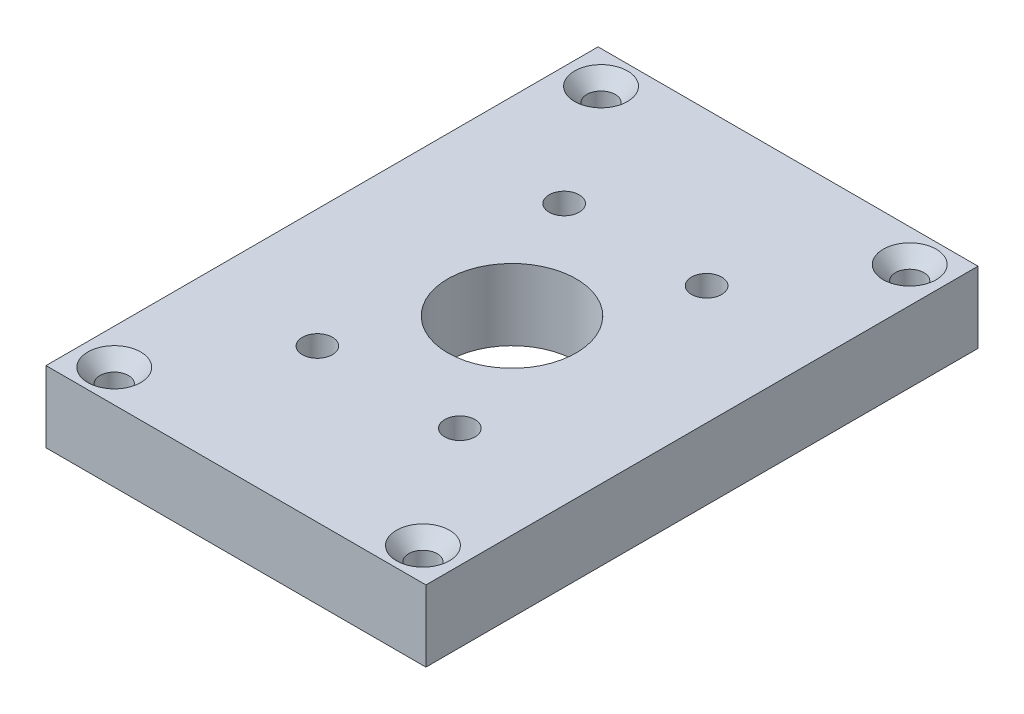
ISO-10303-21;
HEADER;
FILE_DESCRIPTION(('STEP AP214'),'2;1');
FILE_NAME('part.step','',(''),(''),'','','');
FILE_SCHEMA(('AUTOMOTIVE_DESIGN { 1 0 10303 214 1 1 1 1 }'));
ENDSEC;
DATA;
#1=APPLICATION_CONTEXT('core data for automotive mechanical design processes');
#2=APPLICATION_PROTOCOL_DEFINITION('international standard','automotive_design',2000,#1);
#3=PRODUCT_CONTEXT('',#1,'mechanical');
#4=PRODUCT('Part','Part','',(#3));
#5=PRODUCT_RELATED_PRODUCT_CATEGORY('part','',(#4));
#6=PRODUCT_DEFINITION_FORMATION('','',#4);
#7=PRODUCT_DEFINITION_CONTEXT('part definition',#1,'design');
#8=PRODUCT_DEFINITION('design','',#6,#7);
#9=PRODUCT_DEFINITION_SHAPE('','',#8);
#10=(LENGTH_UNIT() NAMED_UNIT(*) SI_UNIT(.MILLI.,.METRE.));
#11=(NAMED_UNIT(*) PLANE_ANGLE_UNIT() SI_UNIT($,.RADIAN.));
#12=(NAMED_UNIT(*) SI_UNIT($,.STERADIAN.) SOLID_ANGLE_UNIT());
#13=UNCERTAINTY_MEASURE_WITH_UNIT(LENGTH_MEASURE(1.E-05),#10,'distance_accuracy_value','');
#14=(GEOMETRIC_REPRESENTATION_CONTEXT(3) GLOBAL_UNCERTAINTY_ASSIGNED_CONTEXT((#13)) GLOBAL_UNIT_ASSIGNED_CONTEXT((#10,
#11,#12)) REPRESENTATION_CONTEXT('',''));
#15=CARTESIAN_POINT('',(0.,0.,0.));
#16=DIRECTION('',(0.,0.,1.));
#17=DIRECTION('',(1.,0.,0.));
#18=AXIS2_PLACEMENT_3D('',#15,#16,#17);
#19=CARTESIAN_POINT('',(25.4,9.525,-36.909375));
#20=DIRECTION('',(0.,-1.,0.));
#21=DIRECTION('',(0.,0.,-1.));
#22=AXIS2_PLACEMENT_3D('',#19,#20,#21);
#23=PLANE('',#22);
#24=CARTESIAN_POINT('',(-9.52499999999996,9.525,16.4977839420936));
#25=DIRECTION('',(0.,1.,0.));
#26=DIRECTION('',(0.,0.,1.));
#27=AXIS2_PLACEMENT_3D('',#24,#25,#26);
#28=CIRCLE('',#27,2.01929999999999);
#29=CARTESIAN_POINT('',(-9.52499999999996,9.525,18.5170839420936));
#30=VERTEX_POINT('',#29);
#31=EDGE_CURVE('E190',#30,#30,#28,.T.);
#32=ORIENTED_EDGE('',*,*,#31,.F.);
#33=EDGE_LOOP('',(#32));
#34=FACE_BOUND('',#33,.T.);
#35=CARTESIAN_POINT('',(-9.52500000000009,9.525,-16.4977839420935));
#36=DIRECTION('',(0.,1.,0.));
#37=DIRECTION('',(0.,0.,1.));
#38=AXIS2_PLACEMENT_3D('',#35,#36,#37);
#39=CIRCLE('',#38,2.01929999999999);
#40=CARTESIAN_POINT('',(-9.52500000000009,9.525,-14.4784839420935));
#41=VERTEX_POINT('',#40);
#42=EDGE_CURVE('E201',#41,#41,#39,.T.);
#43=ORIENTED_EDGE('',*,*,#42,.F.);
#44=EDGE_LOOP('',(#43));
#45=FACE_BOUND('',#44,.T.);
#46=CARTESIAN_POINT('',(9.52499999999996,9.525,-16.4977839420936));
#47=DIRECTION('',(0.,1.,0.));
#48=DIRECTION('',(0.,0.,1.));
#49=AXIS2_PLACEMENT_3D('',#46,#47,#48);
#50=CIRCLE('',#49,2.01929999999999);
#51=CARTESIAN_POINT('',(9.52499999999996,9.525,-14.4784839420936));
#52=VERTEX_POINT('',#51);
#53=EDGE_CURVE('E207',#52,#52,#50,.T.);
#54=ORIENTED_EDGE('',*,*,#53,.F.);
#55=EDGE_LOOP('',(#54));
#56=FACE_BOUND('',#55,.T.);
#57=CARTESIAN_POINT('',(0.,9.525,0.));
#58=DIRECTION('',(0.,1.,0.));
#59=DIRECTION('',(0.,0.,1.));
#60=AXIS2_PLACEMENT_3D('',#57,#58,#59);
#61=CIRCLE('',#60,8.5852);
#62=CARTESIAN_POINT('',(0.,9.525,8.5852));
#63=VERTEX_POINT('',#62);
#64=EDGE_CURVE('E213',#63,#63,#61,.T.);
#65=ORIENTED_EDGE('',*,*,#64,.F.);
#66=EDGE_LOOP('',(#65));
#67=FACE_BOUND('',#66,.T.);
#68=CARTESIAN_POINT('',(-20.6375,9.525,-32.54375));
#69=DIRECTION('',(0.,1.,0.));
#70=DIRECTION('',(0.,0.,1.));
#71=AXIS2_PLACEMENT_3D('',#68,#69,#70);
#72=CIRCLE('',#71,3.5433);
#73=CARTESIAN_POINT('',(-20.6375,9.525,-29.00045));
#74=VERTEX_POINT('',#73);
#75=EDGE_CURVE('E330',#74,#74,#72,.T.);
#76=ORIENTED_EDGE('',*,*,#75,.F.);
#77=EDGE_LOOP('',(#76));
#78=FACE_BOUND('',#77,.T.);
#79=CARTESIAN_POINT('',(20.6375,9.525,-32.54375));
#80=DIRECTION('',(0.,1.,0.));
#81=DIRECTION('',(0.,0.,1.));
#82=AXIS2_PLACEMENT_3D('',#79,#80,#81);
#83=CIRCLE('',#82,3.5433);
#84=CARTESIAN_POINT('',(20.6375,9.525,-29.00045));
#85=VERTEX_POINT('',#84);
#86=EDGE_CURVE('E352',#85,#85,#83,.T.);
#87=ORIENTED_EDGE('',*,*,#86,.F.);
#88=EDGE_LOOP('',(#87));
#89=FACE_BOUND('',#88,.T.);
#90=CARTESIAN_POINT('',(20.6375,9.525,32.54375));
#91=DIRECTION('',(0.,1.,0.));
#92=DIRECTION('',(0.,0.,1.));
#93=AXIS2_PLACEMENT_3D('',#90,#91,#92);
#94=CIRCLE('',#93,3.5433);
#95=CARTESIAN_POINT('',(20.6375,9.525,36.08705));
#96=VERTEX_POINT('',#95);
#97=EDGE_CURVE('E361',#96,#96,#94,.T.);
#98=ORIENTED_EDGE('',*,*,#97,.F.);
#99=EDGE_LOOP('',(#98));
#100=FACE_BOUND('',#99,.T.);
#101=CARTESIAN_POINT('',(-20.6375,9.525,32.54375));
#102=DIRECTION('',(0.,1.,0.));
#103=DIRECTION('',(0.,0.,1.));
#104=AXIS2_PLACEMENT_3D('',#101,#102,#103);
#105=CIRCLE('',#104,3.5433);
#106=CARTESIAN_POINT('',(-20.6375,9.525,36.08705));
#107=VERTEX_POINT('',#106);
#108=EDGE_CURVE('E370',#107,#107,#105,.T.);
#109=ORIENTED_EDGE('',*,*,#108,.F.);
#110=EDGE_LOOP('',(#109));
#111=FACE_BOUND('',#110,.T.);
#112=DIRECTION('',(0.,0.,-1.));
#113=VECTOR('',#112,1.);
#114=CARTESIAN_POINT('',(25.4,9.525,36.909375));
#115=LINE('',#114,#113);
#116=CARTESIAN_POINT('',(25.4,9.525,36.909375));
#117=VERTEX_POINT('',#116);
#118=CARTESIAN_POINT('',(25.4,9.525,-36.909375));
#119=VERTEX_POINT('',#118);
#120=EDGE_CURVE('E380',#117,#119,#115,.T.);
#121=ORIENTED_EDGE('',*,*,#120,.T.);
#122=DIRECTION('',(-1.,0.,0.));
#123=VECTOR('',#122,1.);
#124=CARTESIAN_POINT('',(-25.4,9.525,-36.909375));
#125=LINE('',#124,#123);
#126=CARTESIAN_POINT('',(-25.4,9.525,-36.909375));
#127=VERTEX_POINT('',#126);
#128=EDGE_CURVE('E383',#119,#127,#125,.T.);
#129=ORIENTED_EDGE('',*,*,#128,.T.);
#130=DIRECTION('',(0.,0.,1.));
#131=VECTOR('',#130,1.);
#132=CARTESIAN_POINT('',(-25.4,9.525,36.909375));
#133=LINE('',#132,#131);
#134=CARTESIAN_POINT('',(-25.4,9.525,36.909375));
#135=VERTEX_POINT('',#134);
#136=EDGE_CURVE('E386',#127,#135,#133,.T.);
#137=ORIENTED_EDGE('',*,*,#136,.T.);
#138=DIRECTION('',(1.,0.,0.));
#139=VECTOR('',#138,1.);
#140=CARTESIAN_POINT('',(-25.4,9.525,36.909375));
#141=LINE('',#140,#139);
#142=EDGE_CURVE('E388',#135,#117,#141,.T.);
#143=ORIENTED_EDGE('',*,*,#142,.T.);
#144=EDGE_LOOP('',(#121,#129,#137,#143));
#145=FACE_BOUND('',#144,.T.);
#146=CARTESIAN_POINT('',(9.5250000000002,9.525,16.4977839420934));
#147=DIRECTION('',(0.,1.,0.));
#148=DIRECTION('',(0.,0.,1.));
#149=AXIS2_PLACEMENT_3D('',#146,#147,#148);
#150=CIRCLE('',#149,2.01929999999999);
#151=CARTESIAN_POINT('',(9.5250000000002,9.525,18.5170839420934));
#152=VERTEX_POINT('',#151);
#153=EDGE_CURVE('E191',#152,#152,#150,.T.);
#154=ORIENTED_EDGE('',*,*,#153,.F.);
#155=EDGE_LOOP('',(#154));
#156=FACE_BOUND('',#155,.T.);
#157=ADVANCED_FACE('F32',(#34,#45,#56,#67,#78,#89,#100,#111,#145,#156),#23,.F.);
#158=CARTESIAN_POINT('',(25.4,9.525,36.909375));
#159=DIRECTION('',(-1.,0.,0.));
#160=DIRECTION('',(0.,0.,1.));
#161=AXIS2_PLACEMENT_3D('',#158,#159,#160);
#162=PLANE('',#161);
#163=DIRECTION('',(0.,0.,-1.));
#164=VECTOR('',#163,1.);
#165=CARTESIAN_POINT('',(25.4,0.,36.909375));
#166=LINE('',#165,#164);
#167=CARTESIAN_POINT('',(25.4,0.,36.909375));
#168=VERTEX_POINT('',#167);
#169=CARTESIAN_POINT('',(25.4,0.,-36.909375));
#170=VERTEX_POINT('',#169);
#171=EDGE_CURVE('E379',#168,#170,#166,.T.);
#172=ORIENTED_EDGE('',*,*,#171,.T.);
#173=DIRECTION('',(0.,-1.,0.));
#174=VECTOR('',#173,1.);
#175=CARTESIAN_POINT('',(25.4,9.525,-36.909375));
#176=LINE('',#175,#174);
#177=EDGE_CURVE('E11',#119,#170,#176,.T.);
#178=ORIENTED_EDGE('',*,*,#177,.F.);
#179=ORIENTED_EDGE('',*,*,#120,.F.);
#180=DIRECTION('',(0.,-1.,0.));
#181=VECTOR('',#180,1.);
#182=CARTESIAN_POINT('',(25.4,9.525,36.909375));
#183=LINE('',#182,#181);
#184=EDGE_CURVE('E390',#117,#168,#183,.T.);
#185=ORIENTED_EDGE('',*,*,#184,.T.);
#186=EDGE_LOOP('',(#172,#178,#179,#185));
#187=FACE_BOUND('',#186,.T.);
#188=ADVANCED_FACE('F34',(#187),#162,.F.);
#189=CARTESIAN_POINT('',(-25.4,9.525,-36.909375));
#190=DIRECTION('',(0.,0.,1.));
#191=DIRECTION('',(1.,0.,0.));
#192=AXIS2_PLACEMENT_3D('',#189,#190,#191);
#193=PLANE('',#192);
#194=DIRECTION('',(-1.,0.,0.));
#195=VECTOR('',#194,1.);
#196=CARTESIAN_POINT('',(-25.4,0.,-36.909375));
#197=LINE('',#196,#195);
#198=CARTESIAN_POINT('',(-25.4,0.,-36.909375));
#199=VERTEX_POINT('',#198);
#200=EDGE_CURVE('E393',#170,#199,#197,.T.);
#201=ORIENTED_EDGE('',*,*,#200,.T.);
#202=DIRECTION('',(0.,-1.,0.));
#203=VECTOR('',#202,1.);
#204=CARTESIAN_POINT('',(-25.4,9.525,-36.909375));
#205=LINE('',#204,#203);
#206=EDGE_CURVE('E40',#127,#199,#205,.T.);
#207=ORIENTED_EDGE('',*,*,#206,.F.);
#208=ORIENTED_EDGE('',*,*,#128,.F.);
#209=ORIENTED_EDGE('',*,*,#177,.T.);
#210=EDGE_LOOP('',(#201,#207,#208,#209));
#211=FACE_BOUND('',#210,.T.);
#212=ADVANCED_FACE('F423',(#211),#193,.F.);
#213=CARTESIAN_POINT('',(-25.4,9.525,36.909375));
#214=DIRECTION('',(1.,0.,0.));
#215=DIRECTION('',(0.,0.,-1.));
#216=AXIS2_PLACEMENT_3D('',#213,#214,#215);
#217=PLANE('',#216);
#218=DIRECTION('',(0.,0.,1.));
#219=VECTOR('',#218,1.);
#220=CARTESIAN_POINT('',(-25.4,0.,36.909375));
#221=LINE('',#220,#219);
#222=CARTESIAN_POINT('',(-25.4,0.,36.909375));
#223=VERTEX_POINT('',#222);
#224=EDGE_CURVE('E395',#199,#223,#221,.T.);
#225=ORIENTED_EDGE('',*,*,#224,.T.);
#226=DIRECTION('',(0.,-1.,0.));
#227=VECTOR('',#226,1.);
#228=CARTESIAN_POINT('',(-25.4,9.525,36.909375));
#229=LINE('',#228,#227);
#230=EDGE_CURVE('E400',#135,#223,#229,.T.);
#231=ORIENTED_EDGE('',*,*,#230,.F.);
#232=ORIENTED_EDGE('',*,*,#136,.F.);
#233=ORIENTED_EDGE('',*,*,#206,.T.);
#234=EDGE_LOOP('',(#225,#231,#232,#233));
#235=FACE_BOUND('',#234,.T.);
#236=ADVANCED_FACE('F407',(#235),#217,.F.);
#237=CARTESIAN_POINT('',(-25.4,9.525,36.909375));
#238=DIRECTION('',(0.,0.,-1.));
#239=DIRECTION('',(-1.,0.,0.));
#240=AXIS2_PLACEMENT_3D('',#237,#238,#239);
#241=PLANE('',#240);
#242=DIRECTION('',(1.,0.,0.));
#243=VECTOR('',#242,1.);
#244=CARTESIAN_POINT('',(-25.4,0.,36.909375));
#245=LINE('',#244,#243);
#246=EDGE_CURVE('E384',#223,#168,#245,.T.);
#247=ORIENTED_EDGE('',*,*,#246,.T.);
#248=ORIENTED_EDGE('',*,*,#184,.F.);
#249=ORIENTED_EDGE('',*,*,#142,.F.);
#250=ORIENTED_EDGE('',*,*,#230,.T.);
#251=EDGE_LOOP('',(#247,#248,#249,#250));
#252=FACE_BOUND('',#251,.T.);
#253=ADVANCED_FACE('F416',(#252),#241,.F.);
#254=CARTESIAN_POINT('',(25.4,0.,-36.909375));
#255=DIRECTION('',(0.,-1.,0.));
#256=DIRECTION('',(0.,0.,-1.));
#257=AXIS2_PLACEMENT_3D('',#254,#255,#256);
#258=PLANE('',#257);
#259=CARTESIAN_POINT('',(11.1125,0.,-26.0731));
#260=DIRECTION('',(0.,-1.,0.));
#261=DIRECTION('',(0.,0.,1.));
#262=AXIS2_PLACEMENT_3D('',#259,#260,#261);
#263=CIRCLE('',#262,8.5344);
#264=CARTESIAN_POINT('',(11.1125,0.,-34.6075));
#265=VERTEX_POINT('',#264);
#266=CARTESIAN_POINT('',(19.6469,0.,-26.0731));
#267=VERTEX_POINT('',#266);
#268=EDGE_CURVE('E47',#265,#267,#263,.T.);
#269=ORIENTED_EDGE('',*,*,#268,.F.);
#270=DIRECTION('',(1.,0.,0.));
#271=VECTOR('',#270,1.);
#272=CARTESIAN_POINT('',(11.1125,0.,-34.6075));
#273=LINE('',#272,#271);
#274=CARTESIAN_POINT('',(-11.1125,0.,-34.6075));
#275=VERTEX_POINT('',#274);
#276=EDGE_CURVE('E285',#275,#265,#273,.T.);
#277=ORIENTED_EDGE('',*,*,#276,.F.);
#278=CARTESIAN_POINT('',(-11.1125,0.,-26.0731));
#279=DIRECTION('',(0.,-1.,0.));
#280=DIRECTION('',(0.,0.,1.));
#281=AXIS2_PLACEMENT_3D('',#278,#279,#280);
#282=CIRCLE('',#281,8.5344);
#283=CARTESIAN_POINT('',(-19.6469,0.,-26.0731));
#284=VERTEX_POINT('',#283);
#285=EDGE_CURVE('E323',#284,#275,#282,.T.);
#286=ORIENTED_EDGE('',*,*,#285,.F.);
#287=DIRECTION('',(0.,0.,-1.));
#288=VECTOR('',#287,1.);
#289=CARTESIAN_POINT('',(-19.6469,0.,26.0731));
#290=LINE('',#289,#288);
#291=CARTESIAN_POINT('',(-19.6469,0.,26.0731));
#292=VERTEX_POINT('',#291);
#293=EDGE_CURVE('E320',#292,#284,#290,.T.);
#294=ORIENTED_EDGE('',*,*,#293,.F.);
#295=CARTESIAN_POINT('',(-11.1125,0.,26.0731));
#296=DIRECTION('',(0.,-1.,0.));
#297=DIRECTION('',(0.,0.,-1.));
#298=AXIS2_PLACEMENT_3D('',#295,#296,#297);
#299=CIRCLE('',#298,8.5344);
#300=CARTESIAN_POINT('',(-11.1125,0.,34.6075));
#301=VERTEX_POINT('',#300);
#302=EDGE_CURVE('E317',#301,#292,#299,.T.);
#303=ORIENTED_EDGE('',*,*,#302,.F.);
#304=DIRECTION('',(-1.,0.,0.));
#305=VECTOR('',#304,1.);
#306=CARTESIAN_POINT('',(11.1125,0.,34.6075));
#307=LINE('',#306,#305);
#308=CARTESIAN_POINT('',(11.1125,0.,34.6075));
#309=VERTEX_POINT('',#308);
#310=EDGE_CURVE('E314',#309,#301,#307,.T.);
#311=ORIENTED_EDGE('',*,*,#310,.F.);
#312=CARTESIAN_POINT('',(11.1125,0.,26.0731));
#313=DIRECTION('',(0.,-1.,0.));
#314=DIRECTION('',(0.,0.,1.));
#315=AXIS2_PLACEMENT_3D('',#312,#313,#314);
#316=CIRCLE('',#315,8.53439999999999);
#317=CARTESIAN_POINT('',(19.6469,0.,26.0731));
#318=VERTEX_POINT('',#317);
#319=EDGE_CURVE('E311',#318,#309,#316,.T.);
#320=ORIENTED_EDGE('',*,*,#319,.F.);
#321=DIRECTION('',(0.,0.,1.));
#322=VECTOR('',#321,1.);
#323=CARTESIAN_POINT('',(19.6469,0.,26.0731));
#324=LINE('',#323,#322);
#325=EDGE_CURVE('E308',#267,#318,#324,.T.);
#326=ORIENTED_EDGE('',*,*,#325,.F.);
#327=EDGE_LOOP('',(#269,#277,#286,#294,#303,#311,#320,#326));
#328=FACE_BOUND('',#327,.T.);
#329=CARTESIAN_POINT('',(-20.6375,0.,-32.54375));
#330=DIRECTION('',(0.,1.,0.));
#331=DIRECTION('',(0.,0.,1.));
#332=AXIS2_PLACEMENT_3D('',#329,#330,#331);
#333=CIRCLE('',#332,1.89865);
#334=CARTESIAN_POINT('',(-20.6375,0.,-30.6451));
#335=VERTEX_POINT('',#334);
#336=EDGE_CURVE('E349',#335,#335,#333,.T.);
#337=ORIENTED_EDGE('',*,*,#336,.T.);
#338=EDGE_LOOP('',(#337));
#339=FACE_BOUND('',#338,.T.);
#340=CARTESIAN_POINT('',(20.6375,0.,-32.54375));
#341=DIRECTION('',(0.,1.,0.));
#342=DIRECTION('',(0.,0.,1.));
#343=AXIS2_PLACEMENT_3D('',#340,#341,#342);
#344=CIRCLE('',#343,1.89865);
#345=CARTESIAN_POINT('',(20.6375,0.,-30.6451));
#346=VERTEX_POINT('',#345);
#347=EDGE_CURVE('E358',#346,#346,#344,.T.);
#348=ORIENTED_EDGE('',*,*,#347,.T.);
#349=EDGE_LOOP('',(#348));
#350=FACE_BOUND('',#349,.T.);
#351=CARTESIAN_POINT('',(20.6375,0.,32.54375));
#352=DIRECTION('',(0.,1.,0.));
#353=DIRECTION('',(0.,0.,1.));
#354=AXIS2_PLACEMENT_3D('',#351,#352,#353);
#355=CIRCLE('',#354,1.89865);
#356=CARTESIAN_POINT('',(20.6375,0.,34.4424));
#357=VERTEX_POINT('',#356);
#358=EDGE_CURVE('E367',#357,#357,#355,.T.);
#359=ORIENTED_EDGE('',*,*,#358,.T.);
#360=EDGE_LOOP('',(#359));
#361=FACE_BOUND('',#360,.T.);
#362=CARTESIAN_POINT('',(-20.6375,0.,32.54375));
#363=DIRECTION('',(0.,1.,0.));
#364=DIRECTION('',(0.,0.,1.));
#365=AXIS2_PLACEMENT_3D('',#362,#363,#364);
#366=CIRCLE('',#365,1.89865);
#367=CARTESIAN_POINT('',(-20.6375,0.,34.4424));
#368=VERTEX_POINT('',#367);
#369=EDGE_CURVE('E376',#368,#368,#366,.T.);
#370=ORIENTED_EDGE('',*,*,#369,.T.);
#371=EDGE_LOOP('',(#370));
#372=FACE_BOUND('',#371,.T.);
#373=ORIENTED_EDGE('',*,*,#171,.F.);
#374=ORIENTED_EDGE('',*,*,#246,.F.);
#375=ORIENTED_EDGE('',*,*,#224,.F.);
#376=ORIENTED_EDGE('',*,*,#200,.F.);
#377=EDGE_LOOP('',(#373,#374,#375,#376));
#378=FACE_BOUND('',#377,.T.);
#379=ADVANCED_FACE('F413',(#328,#339,#350,#361,#372,#378),#258,.T.);
#380=CARTESIAN_POINT('',(-20.6375,9.525,32.54375));
#381=DIRECTION('',(0.,1.,0.));
#382=DIRECTION('',(0.,0.,1.));
#383=AXIS2_PLACEMENT_3D('',#380,#381,#382);
#384=CYLINDRICAL_SURFACE('',#383,1.89865);
#385=ORIENTED_EDGE('',*,*,#369,.F.);
#386=EDGE_LOOP('',(#385));
#387=FACE_BOUND('',#386,.T.);
#388=CARTESIAN_POINT('',(-20.6375,7.63304659906396,32.54375));
#389=DIRECTION('',(0.,1.,0.));
#390=DIRECTION('',(0.,0.,1.));
#391=AXIS2_PLACEMENT_3D('',#388,#389,#390);
#392=CIRCLE('',#391,1.89865);
#393=CARTESIAN_POINT('',(-20.6375,7.63304659906396,34.4424));
#394=VERTEX_POINT('',#393);
#395=EDGE_CURVE('E373',#394,#394,#392,.T.);
#396=ORIENTED_EDGE('',*,*,#395,.T.);
#397=EDGE_LOOP('',(#396));
#398=FACE_BOUND('',#397,.T.);
#399=ADVANCED_FACE('F439',(#387,#398),#384,.F.);
#400=CARTESIAN_POINT('',(-20.6375,9.525,32.54375));
#401=DIRECTION('',(0.,1.,0.));
#402=DIRECTION('',(0.,0.,1.));
#403=AXIS2_PLACEMENT_3D('',#400,#401,#402);
#404=CONICAL_SURFACE('',#403,3.5433,0.715584993317675);
#405=ORIENTED_EDGE('',*,*,#395,.F.);
#406=EDGE_LOOP('',(#405));
#407=FACE_BOUND('',#406,.T.);
#408=ORIENTED_EDGE('',*,*,#108,.T.);
#409=EDGE_LOOP('',(#408));
#410=FACE_BOUND('',#409,.T.);
#411=ADVANCED_FACE('F462',(#407,#410),#404,.F.);
#412=CARTESIAN_POINT('',(20.6375,9.525,32.54375));
#413=DIRECTION('',(0.,1.,0.));
#414=DIRECTION('',(0.,0.,1.));
#415=AXIS2_PLACEMENT_3D('',#412,#413,#414);
#416=CYLINDRICAL_SURFACE('',#415,1.89865);
#417=ORIENTED_EDGE('',*,*,#358,.F.);
#418=EDGE_LOOP('',(#417));
#419=FACE_BOUND('',#418,.T.);
#420=CARTESIAN_POINT('',(20.6375,7.63304659906396,32.54375));
#421=DIRECTION('',(0.,1.,0.));
#422=DIRECTION('',(0.,0.,1.));
#423=AXIS2_PLACEMENT_3D('',#420,#421,#422);
#424=CIRCLE('',#423,1.89865);
#425=CARTESIAN_POINT('',(20.6375,7.63304659906396,34.4424));
#426=VERTEX_POINT('',#425);
#427=EDGE_CURVE('E364',#426,#426,#424,.T.);
#428=ORIENTED_EDGE('',*,*,#427,.T.);
#429=EDGE_LOOP('',(#428));
#430=FACE_BOUND('',#429,.T.);
#431=ADVANCED_FACE('F469',(#419,#430),#416,.F.);
#432=CARTESIAN_POINT('',(20.6375,9.525,32.54375));
#433=DIRECTION('',(0.,1.,0.));
#434=DIRECTION('',(0.,0.,1.));
#435=AXIS2_PLACEMENT_3D('',#432,#433,#434);
#436=CONICAL_SURFACE('',#435,3.5433,0.715584993317675);
#437=ORIENTED_EDGE('',*,*,#427,.F.);
#438=EDGE_LOOP('',(#437));
#439=FACE_BOUND('',#438,.T.);
#440=ORIENTED_EDGE('',*,*,#97,.T.);
#441=EDGE_LOOP('',(#440));
#442=FACE_BOUND('',#441,.T.);
#443=ADVANCED_FACE('F476',(#439,#442),#436,.F.);
#444=CARTESIAN_POINT('',(20.6375,9.525,-32.54375));
#445=DIRECTION('',(0.,1.,0.));
#446=DIRECTION('',(0.,0.,1.));
#447=AXIS2_PLACEMENT_3D('',#444,#445,#446);
#448=CYLINDRICAL_SURFACE('',#447,1.89865);
#449=ORIENTED_EDGE('',*,*,#347,.F.);
#450=EDGE_LOOP('',(#449));
#451=FACE_BOUND('',#450,.T.);
#452=CARTESIAN_POINT('',(20.6375,7.63304659906396,-32.54375));
#453=DIRECTION('',(0.,1.,0.));
#454=DIRECTION('',(0.,0.,1.));
#455=AXIS2_PLACEMENT_3D('',#452,#453,#454);
#456=CIRCLE('',#455,1.89865);
#457=CARTESIAN_POINT('',(20.6375,7.63304659906396,-30.6451));
#458=VERTEX_POINT('',#457);
#459=EDGE_CURVE('E355',#458,#458,#456,.T.);
#460=ORIENTED_EDGE('',*,*,#459,.T.);
#461=EDGE_LOOP('',(#460));
#462=FACE_BOUND('',#461,.T.);
#463=ADVANCED_FACE('F484',(#451,#462),#448,.F.);
#464=CARTESIAN_POINT('',(20.6375,9.525,-32.54375));
#465=DIRECTION('',(0.,1.,0.));
#466=DIRECTION('',(0.,0.,1.));
#467=AXIS2_PLACEMENT_3D('',#464,#465,#466);
#468=CONICAL_SURFACE('',#467,3.5433,0.715584993317675);
#469=ORIENTED_EDGE('',*,*,#459,.F.);
#470=EDGE_LOOP('',(#469));
#471=FACE_BOUND('',#470,.T.);
#472=ORIENTED_EDGE('',*,*,#86,.T.);
#473=EDGE_LOOP('',(#472));
#474=FACE_BOUND('',#473,.T.);
#475=ADVANCED_FACE('F492',(#471,#474),#468,.F.);
#476=CARTESIAN_POINT('',(-20.6375,9.525,-32.54375));
#477=DIRECTION('',(0.,1.,0.));
#478=DIRECTION('',(0.,0.,1.));
#479=AXIS2_PLACEMENT_3D('',#476,#477,#478);
#480=CYLINDRICAL_SURFACE('',#479,1.89865);
#481=ORIENTED_EDGE('',*,*,#336,.F.);
#482=EDGE_LOOP('',(#481));
#483=FACE_BOUND('',#482,.T.);
#484=CARTESIAN_POINT('',(-20.6375,7.63304659906396,-32.54375));
#485=DIRECTION('',(0.,1.,0.));
#486=DIRECTION('',(0.,0.,1.));
#487=AXIS2_PLACEMENT_3D('',#484,#485,#486);
#488=CIRCLE('',#487,1.89865);
#489=CARTESIAN_POINT('',(-20.6375,7.63304659906396,-30.6451));
#490=VERTEX_POINT('',#489);
#491=EDGE_CURVE('E346',#490,#490,#488,.T.);
#492=ORIENTED_EDGE('',*,*,#491,.T.);
#493=EDGE_LOOP('',(#492));
#494=FACE_BOUND('',#493,.T.);
#495=ADVANCED_FACE('F500',(#483,#494),#480,.F.);
#496=CARTESIAN_POINT('',(-20.6375,9.525,-32.54375));
#497=DIRECTION('',(0.,1.,0.));
#498=DIRECTION('',(0.,0.,1.));
#499=AXIS2_PLACEMENT_3D('',#496,#497,#498);
#500=CONICAL_SURFACE('',#499,3.5433,0.715584993317675);
#501=ORIENTED_EDGE('',*,*,#491,.F.);
#502=EDGE_LOOP('',(#501));
#503=FACE_BOUND('',#502,.T.);
#504=ORIENTED_EDGE('',*,*,#75,.T.);
#505=EDGE_LOOP('',(#504));
#506=FACE_BOUND('',#505,.T.);
#507=ADVANCED_FACE('F508',(#503,#506),#500,.F.);
#508=CARTESIAN_POINT('',(11.1125,1.3208,-26.0731));
#509=DIRECTION('',(0.,-1.,0.));
#510=DIRECTION('',(0.,0.,-1.));
#511=AXIS2_PLACEMENT_3D('',#508,#509,#510);
#512=CYLINDRICAL_SURFACE('',#511,8.5344);
#513=ORIENTED_EDGE('',*,*,#268,.T.);
#514=DIRECTION('',(0.,-1.,0.));
#515=VECTOR('',#514,1.);
#516=CARTESIAN_POINT('',(19.6469,1.3208,-26.0731));
#517=LINE('',#516,#515);
#518=CARTESIAN_POINT('',(19.6469,1.3208,-26.0731));
#519=VERTEX_POINT('',#518);
#520=EDGE_CURVE('E306',#519,#267,#517,.T.);
#521=ORIENTED_EDGE('',*,*,#520,.F.);
#522=CARTESIAN_POINT('',(11.1125,1.3208,-26.0731));
#523=DIRECTION('',(0.,-1.,0.));
#524=DIRECTION('',(0.,0.,1.));
#525=AXIS2_PLACEMENT_3D('',#522,#523,#524);
#526=CIRCLE('',#525,8.5344);
#527=CARTESIAN_POINT('',(11.1125,1.3208,-34.6075));
#528=VERTEX_POINT('',#527);
#529=EDGE_CURVE('E281',#528,#519,#526,.T.);
#530=ORIENTED_EDGE('',*,*,#529,.F.);
#531=DIRECTION('',(0.,-1.,0.));
#532=VECTOR('',#531,1.);
#533=CARTESIAN_POINT('',(11.1125,1.3208,-34.6075));
#534=LINE('',#533,#532);
#535=EDGE_CURVE('E328',#528,#265,#534,.T.);
#536=ORIENTED_EDGE('',*,*,#535,.T.);
#537=EDGE_LOOP('',(#513,#521,#530,#536));
#538=FACE_BOUND('',#537,.T.);
#539=ADVANCED_FACE('F515',(#538),#512,.F.);
#540=CARTESIAN_POINT('',(11.1125,1.3208,-34.6075));
#541=DIRECTION('',(0.,0.,-1.));
#542=DIRECTION('',(-1.,0.,0.));
#543=AXIS2_PLACEMENT_3D('',#540,#541,#542);
#544=PLANE('',#543);
#545=ORIENTED_EDGE('',*,*,#276,.T.);
#546=ORIENTED_EDGE('',*,*,#535,.F.);
#547=DIRECTION('',(1.,0.,0.));
#548=VECTOR('',#547,1.);
#549=CARTESIAN_POINT('',(11.1125,1.3208,-34.6075));
#550=LINE('',#549,#548);
#551=CARTESIAN_POINT('',(-11.1125,1.3208,-34.6075));
#552=VERTEX_POINT('',#551);
#553=EDGE_CURVE('E303',#552,#528,#550,.T.);
#554=ORIENTED_EDGE('',*,*,#553,.F.);
#555=DIRECTION('',(0.,-1.,0.));
#556=VECTOR('',#555,1.);
#557=CARTESIAN_POINT('',(-11.1125,1.3208,-34.6075));
#558=LINE('',#557,#556);
#559=EDGE_CURVE('E331',#552,#275,#558,.T.);
#560=ORIENTED_EDGE('',*,*,#559,.T.);
#561=EDGE_LOOP('',(#545,#546,#554,#560));
#562=FACE_BOUND('',#561,.T.);
#563=ADVANCED_FACE('F522',(#562),#544,.F.);
#564=CARTESIAN_POINT('',(-11.1125,1.3208,-26.0731));
#565=DIRECTION('',(0.,-1.,0.));
#566=DIRECTION('',(0.,0.,-1.));
#567=AXIS2_PLACEMENT_3D('',#564,#565,#566);
#568=CYLINDRICAL_SURFACE('',#567,8.5344);
#569=ORIENTED_EDGE('',*,*,#285,.T.);
#570=ORIENTED_EDGE('',*,*,#559,.F.);
#571=CARTESIAN_POINT('',(-11.1125,1.3208,-26.0731));
#572=DIRECTION('',(0.,-1.,0.));
#573=DIRECTION('',(0.,0.,1.));
#574=AXIS2_PLACEMENT_3D('',#571,#572,#573);
#575=CIRCLE('',#574,8.5344);
#576=CARTESIAN_POINT('',(-19.6469,1.3208,-26.0731));
#577=VERTEX_POINT('',#576);
#578=EDGE_CURVE('E300',#577,#552,#575,.T.);
#579=ORIENTED_EDGE('',*,*,#578,.F.);
#580=DIRECTION('',(0.,-1.,0.));
#581=VECTOR('',#580,1.);
#582=CARTESIAN_POINT('',(-19.6469,1.3208,-26.0731));
#583=LINE('',#582,#581);
#584=EDGE_CURVE('E333',#577,#284,#583,.T.);
#585=ORIENTED_EDGE('',*,*,#584,.T.);
#586=EDGE_LOOP('',(#569,#570,#579,#585));
#587=FACE_BOUND('',#586,.T.);
#588=ADVANCED_FACE('F529',(#587),#568,.F.);
#589=CARTESIAN_POINT('',(-19.6469,1.3208,26.0731));
#590=DIRECTION('',(-1.,0.,0.));
#591=DIRECTION('',(0.,0.,1.));
#592=AXIS2_PLACEMENT_3D('',#589,#590,#591);
#593=PLANE('',#592);
#594=ORIENTED_EDGE('',*,*,#293,.T.);
#595=ORIENTED_EDGE('',*,*,#584,.F.);
#596=DIRECTION('',(0.,0.,-1.));
#597=VECTOR('',#596,1.);
#598=CARTESIAN_POINT('',(-19.6469,1.3208,26.0731));
#599=LINE('',#598,#597);
#600=CARTESIAN_POINT('',(-19.6469,1.3208,26.0731));
#601=VERTEX_POINT('',#600);
#602=EDGE_CURVE('E297',#601,#577,#599,.T.);
#603=ORIENTED_EDGE('',*,*,#602,.F.);
#604=DIRECTION('',(0.,-1.,0.));
#605=VECTOR('',#604,1.);
#606=CARTESIAN_POINT('',(-19.6469,1.3208,26.0731));
#607=LINE('',#606,#605);
#608=EDGE_CURVE('E335',#601,#292,#607,.T.);
#609=ORIENTED_EDGE('',*,*,#608,.T.);
#610=EDGE_LOOP('',(#594,#595,#603,#609));
#611=FACE_BOUND('',#610,.T.);
#612=ADVANCED_FACE('F537',(#611),#593,.F.);
#613=CARTESIAN_POINT('',(-11.1125,1.3208,26.0731));
#614=DIRECTION('',(0.,-1.,0.));
#615=DIRECTION('',(0.,0.,-1.));
#616=AXIS2_PLACEMENT_3D('',#613,#614,#615);
#617=CYLINDRICAL_SURFACE('',#616,8.5344);
#618=ORIENTED_EDGE('',*,*,#302,.T.);
#619=ORIENTED_EDGE('',*,*,#608,.F.);
#620=CARTESIAN_POINT('',(-11.1125,1.3208,26.0731));
#621=DIRECTION('',(0.,-1.,0.));
#622=DIRECTION('',(0.,0.,-1.));
#623=AXIS2_PLACEMENT_3D('',#620,#621,#622);
#624=CIRCLE('',#623,8.5344);
#625=CARTESIAN_POINT('',(-11.1125,1.3208,34.6075));
#626=VERTEX_POINT('',#625);
#627=EDGE_CURVE('E294',#626,#601,#624,.T.);
#628=ORIENTED_EDGE('',*,*,#627,.F.);
#629=DIRECTION('',(0.,-1.,0.));
#630=VECTOR('',#629,1.);
#631=CARTESIAN_POINT('',(-11.1125,1.3208,34.6075));
#632=LINE('',#631,#630);
#633=EDGE_CURVE('E337',#626,#301,#632,.T.);
#634=ORIENTED_EDGE('',*,*,#633,.T.);
#635=EDGE_LOOP('',(#618,#619,#628,#634));
#636=FACE_BOUND('',#635,.T.);
#637=ADVANCED_FACE('F545',(#636),#617,.F.);
#638=CARTESIAN_POINT('',(11.1125,1.3208,34.6075));
#639=DIRECTION('',(0.,0.,1.));
#640=DIRECTION('',(1.,0.,0.));
#641=AXIS2_PLACEMENT_3D('',#638,#639,#640);
#642=PLANE('',#641);
#643=ORIENTED_EDGE('',*,*,#310,.T.);
#644=ORIENTED_EDGE('',*,*,#633,.F.);
#645=DIRECTION('',(-1.,0.,0.));
#646=VECTOR('',#645,1.);
#647=CARTESIAN_POINT('',(11.1125,1.3208,34.6075));
#648=LINE('',#647,#646);
#649=CARTESIAN_POINT('',(11.1125,1.3208,34.6075));
#650=VERTEX_POINT('',#649);
#651=EDGE_CURVE('E291',#650,#626,#648,.T.);
#652=ORIENTED_EDGE('',*,*,#651,.F.);
#653=DIRECTION('',(0.,-1.,0.));
#654=VECTOR('',#653,1.);
#655=CARTESIAN_POINT('',(11.1125,1.3208,34.6075));
#656=LINE('',#655,#654);
#657=EDGE_CURVE('E339',#650,#309,#656,.T.);
#658=ORIENTED_EDGE('',*,*,#657,.T.);
#659=EDGE_LOOP('',(#643,#644,#652,#658));
#660=FACE_BOUND('',#659,.T.);
#661=ADVANCED_FACE('F553',(#660),#642,.F.);
#662=CARTESIAN_POINT('',(11.1125,1.3208,26.0731));
#663=DIRECTION('',(0.,-1.,0.));
#664=DIRECTION('',(0.,0.,-1.));
#665=AXIS2_PLACEMENT_3D('',#662,#663,#664);
#666=CYLINDRICAL_SURFACE('',#665,8.53439999999999);
#667=ORIENTED_EDGE('',*,*,#319,.T.);
#668=ORIENTED_EDGE('',*,*,#657,.F.);
#669=CARTESIAN_POINT('',(11.1125,1.3208,26.0731));
#670=DIRECTION('',(0.,-1.,0.));
#671=DIRECTION('',(0.,0.,1.));
#672=AXIS2_PLACEMENT_3D('',#669,#670,#671);
#673=CIRCLE('',#672,8.53439999999999);
#674=CARTESIAN_POINT('',(19.6469,1.3208,26.0731));
#675=VERTEX_POINT('',#674);
#676=EDGE_CURVE('E288',#675,#650,#673,.T.);
#677=ORIENTED_EDGE('',*,*,#676,.F.);
#678=DIRECTION('',(0.,-1.,0.));
#679=VECTOR('',#678,1.);
#680=CARTESIAN_POINT('',(19.6469,1.3208,26.0731));
#681=LINE('',#680,#679);
#682=EDGE_CURVE('E341',#675,#318,#681,.T.);
#683=ORIENTED_EDGE('',*,*,#682,.T.);
#684=EDGE_LOOP('',(#667,#668,#677,#683));
#685=FACE_BOUND('',#684,.T.);
#686=ADVANCED_FACE('F561',(#685),#666,.F.);
#687=CARTESIAN_POINT('',(19.6469,1.3208,26.0731));
#688=DIRECTION('',(1.,0.,0.));
#689=DIRECTION('',(0.,0.,-1.));
#690=AXIS2_PLACEMENT_3D('',#687,#688,#689);
#691=PLANE('',#690);
#692=ORIENTED_EDGE('',*,*,#325,.T.);
#693=ORIENTED_EDGE('',*,*,#682,.F.);
#694=DIRECTION('',(0.,0.,1.));
#695=VECTOR('',#694,1.);
#696=CARTESIAN_POINT('',(19.6469,1.3208,26.0731));
#697=LINE('',#696,#695);
#698=EDGE_CURVE('E284',#519,#675,#697,.T.);
#699=ORIENTED_EDGE('',*,*,#698,.F.);
#700=ORIENTED_EDGE('',*,*,#520,.T.);
#701=EDGE_LOOP('',(#692,#693,#699,#700));
#702=FACE_BOUND('',#701,.T.);
#703=ADVANCED_FACE('F569',(#702),#691,.F.);
#704=CARTESIAN_POINT('',(11.1125,1.3208,-26.0731));
#705=DIRECTION('',(0.,1.,0.));
#706=DIRECTION('',(0.,0.,1.));
#707=AXIS2_PLACEMENT_3D('',#704,#705,#706);
#708=PLANE('',#707);
#709=CARTESIAN_POINT('',(11.1125,1.3208,26.0731));
#710=DIRECTION('',(0.,-1.,0.));
#711=DIRECTION('',(0.,0.,1.));
#712=AXIS2_PLACEMENT_3D('',#709,#710,#711);
#713=CIRCLE('',#712,6.35);
#714=CARTESIAN_POINT('',(17.4625,1.3208,26.0731));
#715=VERTEX_POINT('',#714);
#716=CARTESIAN_POINT('',(11.1125,1.3208,32.4231));
#717=VERTEX_POINT('',#716);
#718=EDGE_CURVE('E220',#715,#717,#713,.T.);
#719=ORIENTED_EDGE('',*,*,#718,.F.);
#720=DIRECTION('',(0.,0.,1.));
#721=VECTOR('',#720,1.);
#722=CARTESIAN_POINT('',(17.4625,1.3208,26.0731));
#723=LINE('',#722,#721);
#724=CARTESIAN_POINT('',(17.4625,1.3208,-26.0731));
#725=VERTEX_POINT('',#724);
#726=EDGE_CURVE('E242',#725,#715,#723,.T.);
#727=ORIENTED_EDGE('',*,*,#726,.F.);
#728=CARTESIAN_POINT('',(11.1125,1.3208,-26.0731));
#729=DIRECTION('',(0.,-1.,0.));
#730=DIRECTION('',(0.,0.,1.));
#731=AXIS2_PLACEMENT_3D('',#728,#729,#730);
#732=CIRCLE('',#731,6.35);
#733=CARTESIAN_POINT('',(11.1125,1.3208,-32.4231));
#734=VERTEX_POINT('',#733);
#735=EDGE_CURVE('E239',#734,#725,#732,.T.);
#736=ORIENTED_EDGE('',*,*,#735,.F.);
#737=DIRECTION('',(1.,0.,0.));
#738=VECTOR('',#737,1.);
#739=CARTESIAN_POINT('',(11.1125,1.3208,-32.4231));
#740=LINE('',#739,#738);
#741=CARTESIAN_POINT('',(-11.1125,1.3208,-32.4231));
#742=VERTEX_POINT('',#741);
#743=EDGE_CURVE('E236',#742,#734,#740,.T.);
#744=ORIENTED_EDGE('',*,*,#743,.F.);
#745=CARTESIAN_POINT('',(-11.1125,1.3208,-26.0731));
#746=DIRECTION('',(0.,-1.,0.));
#747=DIRECTION('',(0.,0.,1.));
#748=AXIS2_PLACEMENT_3D('',#745,#746,#747);
#749=CIRCLE('',#748,6.35);
#750=CARTESIAN_POINT('',(-17.4625,1.3208,-26.0731));
#751=VERTEX_POINT('',#750);
#752=EDGE_CURVE('E233',#751,#742,#749,.T.);
#753=ORIENTED_EDGE('',*,*,#752,.F.);
#754=DIRECTION('',(0.,0.,-1.));
#755=VECTOR('',#754,1.);
#756=CARTESIAN_POINT('',(-17.4625,1.3208,26.0731));
#757=LINE('',#756,#755);
#758=CARTESIAN_POINT('',(-17.4625,1.3208,26.0731));
#759=VERTEX_POINT('',#758);
#760=EDGE_CURVE('E230',#759,#751,#757,.T.);
#761=ORIENTED_EDGE('',*,*,#760,.F.);
#762=CARTESIAN_POINT('',(-11.1125,1.3208,26.0731));
#763=DIRECTION('',(0.,-1.,0.));
#764=DIRECTION('',(0.,0.,-1.));
#765=AXIS2_PLACEMENT_3D('',#762,#763,#764);
#766=CIRCLE('',#765,6.35);
#767=CARTESIAN_POINT('',(-11.1125,1.3208,32.4231));
#768=VERTEX_POINT('',#767);
#769=EDGE_CURVE('E227',#768,#759,#766,.T.);
#770=ORIENTED_EDGE('',*,*,#769,.F.);
#771=DIRECTION('',(-1.,0.,0.));
#772=VECTOR('',#771,1.);
#773=CARTESIAN_POINT('',(11.1125,1.3208,32.4231));
#774=LINE('',#773,#772);
#775=EDGE_CURVE('E223',#717,#768,#774,.T.);
#776=ORIENTED_EDGE('',*,*,#775,.F.);
#777=EDGE_LOOP('',(#719,#727,#736,#744,#753,#761,#770,#776));
#778=FACE_BOUND('',#777,.T.);
#779=ORIENTED_EDGE('',*,*,#529,.T.);
#780=ORIENTED_EDGE('',*,*,#698,.T.);
#781=ORIENTED_EDGE('',*,*,#676,.T.);
#782=ORIENTED_EDGE('',*,*,#651,.T.);
#783=ORIENTED_EDGE('',*,*,#627,.T.);
#784=ORIENTED_EDGE('',*,*,#602,.T.);
#785=ORIENTED_EDGE('',*,*,#578,.T.);
#786=ORIENTED_EDGE('',*,*,#553,.T.);
#787=EDGE_LOOP('',(#779,#780,#781,#782,#783,#784,#785,#786));
#788=FACE_BOUND('',#787,.T.);
#789=ADVANCED_FACE('F577',(#778,#788),#708,.F.);
#790=CARTESIAN_POINT('',(11.1125,1.3208,26.0731));
#791=DIRECTION('',(0.,-1.,0.));
#792=DIRECTION('',(0.,0.,-1.));
#793=AXIS2_PLACEMENT_3D('',#790,#791,#792);
#794=CYLINDRICAL_SURFACE('',#793,6.35);
#795=CARTESIAN_POINT('',(11.1125,0.,26.0731));
#796=DIRECTION('',(0.,-1.,0.));
#797=DIRECTION('',(0.,0.,1.));
#798=AXIS2_PLACEMENT_3D('',#795,#796,#797);
#799=CIRCLE('',#798,6.35);
#800=CARTESIAN_POINT('',(17.4625,0.,26.0731));
#801=VERTEX_POINT('',#800);
#802=CARTESIAN_POINT('',(11.1125,0.,32.4231));
#803=VERTEX_POINT('',#802);
#804=EDGE_CURVE('E217',#801,#803,#799,.T.);
#805=ORIENTED_EDGE('',*,*,#804,.F.);
#806=DIRECTION('',(0.,-1.,0.));
#807=VECTOR('',#806,1.);
#808=CARTESIAN_POINT('',(17.4625,1.3208,26.0731));
#809=LINE('',#808,#807);
#810=EDGE_CURVE('E266',#715,#801,#809,.T.);
#811=ORIENTED_EDGE('',*,*,#810,.F.);
#812=ORIENTED_EDGE('',*,*,#718,.T.);
#813=DIRECTION('',(0.,-1.,0.));
#814=VECTOR('',#813,1.);
#815=CARTESIAN_POINT('',(11.1125,1.3208,32.4231));
#816=LINE('',#815,#814);
#817=EDGE_CURVE('E245',#717,#803,#816,.T.);
#818=ORIENTED_EDGE('',*,*,#817,.T.);
#819=EDGE_LOOP('',(#805,#811,#812,#818));
#820=FACE_BOUND('',#819,.T.);
#821=ADVANCED_FACE('F585',(#820),#794,.T.);
#822=CARTESIAN_POINT('',(17.4625,1.3208,26.0731));
#823=DIRECTION('',(1.,0.,0.));
#824=DIRECTION('',(0.,0.,-1.));
#825=AXIS2_PLACEMENT_3D('',#822,#823,#824);
#826=PLANE('',#825);
#827=DIRECTION('',(0.,0.,1.));
#828=VECTOR('',#827,1.);
#829=CARTESIAN_POINT('',(17.4625,0.,26.0731));
#830=LINE('',#829,#828);
#831=CARTESIAN_POINT('',(17.4625,0.,-26.0731));
#832=VERTEX_POINT('',#831);
#833=EDGE_CURVE('E224',#832,#801,#830,.T.);
#834=ORIENTED_EDGE('',*,*,#833,.F.);
#835=DIRECTION('',(0.,-1.,0.));
#836=VECTOR('',#835,1.);
#837=CARTESIAN_POINT('',(17.4625,1.3208,-26.0731));
#838=LINE('',#837,#836);
#839=EDGE_CURVE('E268',#725,#832,#838,.T.);
#840=ORIENTED_EDGE('',*,*,#839,.F.);
#841=ORIENTED_EDGE('',*,*,#726,.T.);
#842=ORIENTED_EDGE('',*,*,#810,.T.);
#843=EDGE_LOOP('',(#834,#840,#841,#842));
#844=FACE_BOUND('',#843,.T.);
#845=ADVANCED_FACE('F593',(#844),#826,.T.);
#846=CARTESIAN_POINT('',(11.1125,1.3208,-26.0731));
#847=DIRECTION('',(0.,-1.,0.));
#848=DIRECTION('',(0.,0.,-1.));
#849=AXIS2_PLACEMENT_3D('',#846,#847,#848);
#850=CYLINDRICAL_SURFACE('',#849,6.35);
#851=CARTESIAN_POINT('',(11.1125,0.,-26.0731));
#852=DIRECTION('',(0.,-1.,0.));
#853=DIRECTION('',(0.,0.,1.));
#854=AXIS2_PLACEMENT_3D('',#851,#852,#853);
#855=CIRCLE('',#854,6.35);
#856=CARTESIAN_POINT('',(11.1125,0.,-32.4231));
#857=VERTEX_POINT('',#856);
#858=EDGE_CURVE('E261',#857,#832,#855,.T.);
#859=ORIENTED_EDGE('',*,*,#858,.F.);
#860=DIRECTION('',(0.,-1.,0.));
#861=VECTOR('',#860,1.);
#862=CARTESIAN_POINT('',(11.1125,1.3208,-32.4231));
#863=LINE('',#862,#861);
#864=EDGE_CURVE('E270',#734,#857,#863,.T.);
#865=ORIENTED_EDGE('',*,*,#864,.F.);
#866=ORIENTED_EDGE('',*,*,#735,.T.);
#867=ORIENTED_EDGE('',*,*,#839,.T.);
#868=EDGE_LOOP('',(#859,#865,#866,#867));
#869=FACE_BOUND('',#868,.T.);
#870=ADVANCED_FACE('F601',(#869),#850,.T.);
#871=CARTESIAN_POINT('',(11.1125,1.3208,-32.4231));
#872=DIRECTION('',(0.,0.,-1.));
#873=DIRECTION('',(-1.,0.,0.));
#874=AXIS2_PLACEMENT_3D('',#871,#872,#873);
#875=PLANE('',#874);
#876=DIRECTION('',(1.,0.,0.));
#877=VECTOR('',#876,1.);
#878=CARTESIAN_POINT('',(11.1125,0.,-32.4231));
#879=LINE('',#878,#877);
#880=CARTESIAN_POINT('',(-11.1125,0.,-32.4231));
#881=VERTEX_POINT('',#880);
#882=EDGE_CURVE('E258',#881,#857,#879,.T.);
#883=ORIENTED_EDGE('',*,*,#882,.F.);
#884=DIRECTION('',(0.,-1.,0.));
#885=VECTOR('',#884,1.);
#886=CARTESIAN_POINT('',(-11.1125,1.3208,-32.4231));
#887=LINE('',#886,#885);
#888=EDGE_CURVE('E272',#742,#881,#887,.T.);
#889=ORIENTED_EDGE('',*,*,#888,.F.);
#890=ORIENTED_EDGE('',*,*,#743,.T.);
#891=ORIENTED_EDGE('',*,*,#864,.T.);
#892=EDGE_LOOP('',(#883,#889,#890,#891));
#893=FACE_BOUND('',#892,.T.);
#894=ADVANCED_FACE('F609',(#893),#875,.T.);
#895=CARTESIAN_POINT('',(-11.1125,1.3208,-26.0731));
#896=DIRECTION('',(0.,-1.,0.));
#897=DIRECTION('',(0.,0.,-1.));
#898=AXIS2_PLACEMENT_3D('',#895,#896,#897);
#899=CYLINDRICAL_SURFACE('',#898,6.35);
#900=CARTESIAN_POINT('',(-11.1125,0.,-26.0731));
#901=DIRECTION('',(0.,-1.,0.));
#902=DIRECTION('',(0.,0.,1.));
#903=AXIS2_PLACEMENT_3D('',#900,#901,#902);
#904=CIRCLE('',#903,6.35);
#905=CARTESIAN_POINT('',(-17.4625,0.,-26.0731));
#906=VERTEX_POINT('',#905);
#907=EDGE_CURVE('E255',#906,#881,#904,.T.);
#908=ORIENTED_EDGE('',*,*,#907,.F.);
#909=DIRECTION('',(0.,-1.,0.));
#910=VECTOR('',#909,1.);
#911=CARTESIAN_POINT('',(-17.4625,1.3208,-26.0731));
#912=LINE('',#911,#910);
#913=EDGE_CURVE('E274',#751,#906,#912,.T.);
#914=ORIENTED_EDGE('',*,*,#913,.F.);
#915=ORIENTED_EDGE('',*,*,#752,.T.);
#916=ORIENTED_EDGE('',*,*,#888,.T.);
#917=EDGE_LOOP('',(#908,#914,#915,#916));
#918=FACE_BOUND('',#917,.T.);
#919=ADVANCED_FACE('F617',(#918),#899,.T.);
#920=CARTESIAN_POINT('',(-17.4625,1.3208,26.0731));
#921=DIRECTION('',(-1.,0.,0.));
#922=DIRECTION('',(0.,0.,1.));
#923=AXIS2_PLACEMENT_3D('',#920,#921,#922);
#924=PLANE('',#923);
#925=DIRECTION('',(0.,0.,-1.));
#926=VECTOR('',#925,1.);
#927=CARTESIAN_POINT('',(-17.4625,0.,26.0731));
#928=LINE('',#927,#926);
#929=CARTESIAN_POINT('',(-17.4625,0.,26.0731));
#930=VERTEX_POINT('',#929);
#931=EDGE_CURVE('E252',#930,#906,#928,.T.);
#932=ORIENTED_EDGE('',*,*,#931,.F.);
#933=DIRECTION('',(0.,-1.,0.));
#934=VECTOR('',#933,1.);
#935=CARTESIAN_POINT('',(-17.4625,1.3208,26.0731));
#936=LINE('',#935,#934);
#937=EDGE_CURVE('E276',#759,#930,#936,.T.);
#938=ORIENTED_EDGE('',*,*,#937,.F.);
#939=ORIENTED_EDGE('',*,*,#760,.T.);
#940=ORIENTED_EDGE('',*,*,#913,.T.);
#941=EDGE_LOOP('',(#932,#938,#939,#940));
#942=FACE_BOUND('',#941,.T.);
#943=ADVANCED_FACE('F625',(#942),#924,.T.);
#944=CARTESIAN_POINT('',(-11.1125,1.3208,26.0731));
#945=DIRECTION('',(0.,-1.,0.));
#946=DIRECTION('',(0.,0.,-1.));
#947=AXIS2_PLACEMENT_3D('',#944,#945,#946);
#948=CYLINDRICAL_SURFACE('',#947,6.35);
#949=CARTESIAN_POINT('',(-11.1125,0.,26.0731));
#950=DIRECTION('',(0.,-1.,0.));
#951=DIRECTION('',(0.,0.,-1.));
#952=AXIS2_PLACEMENT_3D('',#949,#950,#951);
#953=CIRCLE('',#952,6.35);
#954=CARTESIAN_POINT('',(-11.1125,0.,32.4231));
#955=VERTEX_POINT('',#954);
#956=EDGE_CURVE('E55',#955,#930,#953,.T.);
#957=ORIENTED_EDGE('',*,*,#956,.F.);
#958=DIRECTION('',(0.,-1.,0.));
#959=VECTOR('',#958,1.);
#960=CARTESIAN_POINT('',(-11.1125,1.3208,32.4231));
#961=LINE('',#960,#959);
#962=EDGE_CURVE('E278',#768,#955,#961,.T.);
#963=ORIENTED_EDGE('',*,*,#962,.F.);
#964=ORIENTED_EDGE('',*,*,#769,.T.);
#965=ORIENTED_EDGE('',*,*,#937,.T.);
#966=EDGE_LOOP('',(#957,#963,#964,#965));
#967=FACE_BOUND('',#966,.T.);
#968=ADVANCED_FACE('F633',(#967),#948,.T.);
#969=CARTESIAN_POINT('',(11.1125,1.3208,32.4231));
#970=DIRECTION('',(0.,0.,1.));
#971=DIRECTION('',(1.,0.,0.));
#972=AXIS2_PLACEMENT_3D('',#969,#970,#971);
#973=PLANE('',#972);
#974=DIRECTION('',(-1.,0.,0.));
#975=VECTOR('',#974,1.);
#976=CARTESIAN_POINT('',(11.1125,0.,32.4231));
#977=LINE('',#976,#975);
#978=EDGE_CURVE('E248',#803,#955,#977,.T.);
#979=ORIENTED_EDGE('',*,*,#978,.F.);
#980=ORIENTED_EDGE('',*,*,#817,.F.);
#981=ORIENTED_EDGE('',*,*,#775,.T.);
#982=ORIENTED_EDGE('',*,*,#962,.T.);
#983=EDGE_LOOP('',(#979,#980,#981,#982));
#984=FACE_BOUND('',#983,.T.);
#985=ADVANCED_FACE('F641',(#984),#973,.T.);
#986=CARTESIAN_POINT('',(0.,0.,0.));
#987=DIRECTION('',(0.,1.,0.));
#988=DIRECTION('',(0.,0.,1.));
#989=AXIS2_PLACEMENT_3D('',#986,#987,#988);
#990=CIRCLE('',#989,8.5852);
#991=CARTESIAN_POINT('',(0.,0.,8.5852));
#992=VERTEX_POINT('',#991);
#993=EDGE_CURVE('E214',#992,#992,#990,.T.);
#994=ORIENTED_EDGE('',*,*,#993,.T.);
#995=EDGE_LOOP('',(#994));
#996=FACE_BOUND('',#995,.T.);
#997=ORIENTED_EDGE('',*,*,#833,.T.);
#998=ORIENTED_EDGE('',*,*,#804,.T.);
#999=ORIENTED_EDGE('',*,*,#978,.T.);
#1000=ORIENTED_EDGE('',*,*,#956,.T.);
#1001=ORIENTED_EDGE('',*,*,#931,.T.);
#1002=ORIENTED_EDGE('',*,*,#907,.T.);
#1003=ORIENTED_EDGE('',*,*,#882,.T.);
#1004=ORIENTED_EDGE('',*,*,#858,.T.);
#1005=EDGE_LOOP('',(#997,#998,#999,#1000,#1001,#1002,#1003,#1004));
#1006=FACE_BOUND('',#1005,.T.);
#1007=ADVANCED_FACE('F444',(#996,#1006),#258,.T.);
#1008=CARTESIAN_POINT('',(0.,0.,0.));
#1009=DIRECTION('',(0.,1.,0.));
#1010=DIRECTION('',(0.,0.,1.));
#1011=AXIS2_PLACEMENT_3D('',#1008,#1009,#1010);
#1012=CYLINDRICAL_SURFACE('',#1011,8.5852);
#1013=ORIENTED_EDGE('',*,*,#993,.F.);
#1014=EDGE_LOOP('',(#1013));
#1015=FACE_BOUND('',#1014,.T.);
#1016=ORIENTED_EDGE('',*,*,#64,.T.);
#1017=EDGE_LOOP('',(#1016));
#1018=FACE_BOUND('',#1017,.T.);
#1019=ADVANCED_FACE('F655',(#1015,#1018),#1012,.F.);
#1020=CARTESIAN_POINT('',(9.52499999999996,3.175,-16.4977839420936));
#1021=DIRECTION('',(0.,1.,0.));
#1022=DIRECTION('',(0.,0.,1.));
#1023=AXIS2_PLACEMENT_3D('',#1020,#1021,#1022);
#1024=CONICAL_SURFACE('',#1023,2.0193,1.02974425867665);
#1025=CARTESIAN_POINT('',(9.52499999999995,1.96168215199765,-16.4977839420936));
#1026=VERTEX_POINT('',#1025);
#1027=VERTEX_LOOP('',#1026);
#1028=FACE_BOUND('',#1027,.T.);
#1029=CARTESIAN_POINT('',(9.52499999999996,3.175,-16.4977839420936));
#1030=DIRECTION('',(0.,1.,0.));
#1031=DIRECTION('',(0.,0.,1.));
#1032=AXIS2_PLACEMENT_3D('',#1029,#1030,#1031);
#1033=CIRCLE('',#1032,2.0193);
#1034=CARTESIAN_POINT('',(9.52499999999996,3.175,-14.4784839420936));
#1035=VERTEX_POINT('',#1034);
#1036=EDGE_CURVE('E210',#1035,#1035,#1033,.T.);
#1037=ORIENTED_EDGE('',*,*,#1036,.T.);
#1038=EDGE_LOOP('',(#1037));
#1039=FACE_BOUND('',#1038,.T.);
#1040=ADVANCED_FACE('F662',(#1028,#1039),#1024,.F.);
#1041=CARTESIAN_POINT('',(9.52499999999996,9.525,-16.4977839420936));
#1042=DIRECTION('',(0.,1.,0.));
#1043=DIRECTION('',(0.,0.,1.));
#1044=AXIS2_PLACEMENT_3D('',#1041,#1042,#1043);
#1045=CYLINDRICAL_SURFACE('',#1044,2.01929999999999);
#1046=ORIENTED_EDGE('',*,*,#1036,.F.);
#1047=EDGE_LOOP('',(#1046));
#1048=FACE_BOUND('',#1047,.T.);
#1049=ORIENTED_EDGE('',*,*,#53,.T.);
#1050=EDGE_LOOP('',(#1049));
#1051=FACE_BOUND('',#1050,.T.);
#1052=ADVANCED_FACE('F670',(#1048,#1051),#1045,.F.);
#1053=CARTESIAN_POINT('',(-9.52500000000009,3.175,-16.4977839420935));
#1054=DIRECTION('',(0.,1.,0.));
#1055=DIRECTION('',(0.,0.,1.));
#1056=AXIS2_PLACEMENT_3D('',#1053,#1054,#1055);
#1057=CONICAL_SURFACE('',#1056,2.0193,1.02974425867665);
#1058=CARTESIAN_POINT('',(-9.52500000000009,1.96168215199765,-16.4977839420935));
#1059=VERTEX_POINT('',#1058);
#1060=VERTEX_LOOP('',#1059);
#1061=FACE_BOUND('',#1060,.T.);
#1062=CARTESIAN_POINT('',(-9.52500000000009,3.175,-16.4977839420935));
#1063=DIRECTION('',(0.,1.,0.));
#1064=DIRECTION('',(0.,0.,1.));
#1065=AXIS2_PLACEMENT_3D('',#1062,#1063,#1064);
#1066=CIRCLE('',#1065,2.0193);
#1067=CARTESIAN_POINT('',(-9.52500000000009,3.175,-14.4784839420935));
#1068=VERTEX_POINT('',#1067);
#1069=EDGE_CURVE('E204',#1068,#1068,#1066,.T.);
#1070=ORIENTED_EDGE('',*,*,#1069,.T.);
#1071=EDGE_LOOP('',(#1070));
#1072=FACE_BOUND('',#1071,.T.);
#1073=ADVANCED_FACE('F678',(#1061,#1072),#1057,.F.);
#1074=CARTESIAN_POINT('',(-9.52500000000009,9.525,-16.4977839420935));
#1075=DIRECTION('',(0.,1.,0.));
#1076=DIRECTION('',(0.,0.,1.));
#1077=AXIS2_PLACEMENT_3D('',#1074,#1075,#1076);
#1078=CYLINDRICAL_SURFACE('',#1077,2.01929999999999);
#1079=ORIENTED_EDGE('',*,*,#1069,.F.);
#1080=EDGE_LOOP('',(#1079));
#1081=FACE_BOUND('',#1080,.T.);
#1082=ORIENTED_EDGE('',*,*,#42,.T.);
#1083=EDGE_LOOP('',(#1082));
#1084=FACE_BOUND('',#1083,.T.);
#1085=ADVANCED_FACE('F686',(#1081,#1084),#1078,.F.);
#1086=CARTESIAN_POINT('',(-9.52499999999996,3.175,16.4977839420936));
#1087=DIRECTION('',(0.,1.,0.));
#1088=DIRECTION('',(0.,0.,1.));
#1089=AXIS2_PLACEMENT_3D('',#1086,#1087,#1088);
#1090=CONICAL_SURFACE('',#1089,2.0193,1.02974425867665);
#1091=CARTESIAN_POINT('',(-9.52499999999996,1.96168215199765,16.4977839420936));
#1092=VERTEX_POINT('',#1091);
#1093=VERTEX_LOOP('',#1092);
#1094=FACE_BOUND('',#1093,.T.);
#1095=CARTESIAN_POINT('',(-9.52499999999996,3.175,16.4977839420936));
#1096=DIRECTION('',(0.,1.,0.));
#1097=DIRECTION('',(0.,0.,1.));
#1098=AXIS2_PLACEMENT_3D('',#1095,#1096,#1097);
#1099=CIRCLE('',#1098,2.0193);
#1100=CARTESIAN_POINT('',(-9.52499999999996,3.175,18.5170839420936));
#1101=VERTEX_POINT('',#1100);
#1102=EDGE_CURVE('E194',#1101,#1101,#1099,.T.);
#1103=ORIENTED_EDGE('',*,*,#1102,.T.);
#1104=EDGE_LOOP('',(#1103));
#1105=FACE_BOUND('',#1104,.T.);
#1106=ADVANCED_FACE('F694',(#1094,#1105),#1090,.F.);
#1107=CARTESIAN_POINT('',(-9.52499999999996,9.525,16.4977839420936));
#1108=DIRECTION('',(0.,1.,0.));
#1109=DIRECTION('',(0.,0.,1.));
#1110=AXIS2_PLACEMENT_3D('',#1107,#1108,#1109);
#1111=CYLINDRICAL_SURFACE('',#1110,2.01929999999999);
#1112=ORIENTED_EDGE('',*,*,#1102,.F.);
#1113=EDGE_LOOP('',(#1112));
#1114=FACE_BOUND('',#1113,.T.);
#1115=ORIENTED_EDGE('',*,*,#31,.T.);
#1116=EDGE_LOOP('',(#1115));
#1117=FACE_BOUND('',#1116,.T.);
#1118=ADVANCED_FACE('F184',(#1114,#1117),#1111,.F.);
#1119=CARTESIAN_POINT('',(9.5250000000002,3.175,16.4977839420934));
#1120=DIRECTION('',(0.,1.,0.));
#1121=DIRECTION('',(0.,0.,1.));
#1122=AXIS2_PLACEMENT_3D('',#1119,#1120,#1121);
#1123=CONICAL_SURFACE('',#1122,2.0193,1.02974425867665);
#1124=CARTESIAN_POINT('',(9.5250000000002,1.96168215199765,16.4977839420934));
#1125=VERTEX_POINT('',#1124);
#1126=VERTEX_LOOP('',#1125);
#1127=FACE_BOUND('',#1126,.T.);
#1128=CARTESIAN_POINT('',(9.5250000000002,3.175,16.4977839420934));
#1129=DIRECTION('',(0.,1.,0.));
#1130=DIRECTION('',(0.,0.,1.));
#1131=AXIS2_PLACEMENT_3D('',#1128,#1129,#1130);
#1132=CIRCLE('',#1131,2.0193);
#1133=CARTESIAN_POINT('',(9.5250000000002,3.175,18.5170839420934));
#1134=VERTEX_POINT('',#1133);
#1135=EDGE_CURVE('E188',#1134,#1134,#1132,.T.);
#1136=ORIENTED_EDGE('',*,*,#1135,.T.);
#1137=EDGE_LOOP('',(#1136));
#1138=FACE_BOUND('',#1137,.T.);
#1139=ADVANCED_FACE('F180',(#1127,#1138),#1123,.F.);
#1140=CARTESIAN_POINT('',(9.5250000000002,9.525,16.4977839420934));
#1141=DIRECTION('',(0.,1.,0.));
#1142=DIRECTION('',(0.,0.,1.));
#1143=AXIS2_PLACEMENT_3D('',#1140,#1141,#1142);
#1144=CYLINDRICAL_SURFACE('',#1143,2.01929999999999);
#1145=ORIENTED_EDGE('',*,*,#1135,.F.);
#1146=EDGE_LOOP('',(#1145));
#1147=FACE_BOUND('',#1146,.T.);
#1148=ORIENTED_EDGE('',*,*,#153,.T.);
#1149=EDGE_LOOP('',(#1148));
#1150=FACE_BOUND('',#1149,.T.);
#1151=ADVANCED_FACE('F183',(#1147,#1150),#1144,.F.);
#1152=CLOSED_SHELL('',(#157,#188,#212,#236,#253,#379,#399,#411,#431,#443,#463,#475,#495,#507,
#539,#563,#588,#612,#637,#661,#686,#703,#789,#821,#845,#870,#894,#919,#943,#968,#985,#1007,
#1019,#1040,#1052,#1073,#1085,#1106,#1118,#1139,#1151));
#1153=MANIFOLD_SOLID_BREP('B2',#1152);
#1154=ADVANCED_BREP_SHAPE_REPRESENTATION('',(#18,#1153),#14);
#1155=SHAPE_DEFINITION_REPRESENTATION(#9,#1154);
ENDSEC;
END-ISO-10303-21;
